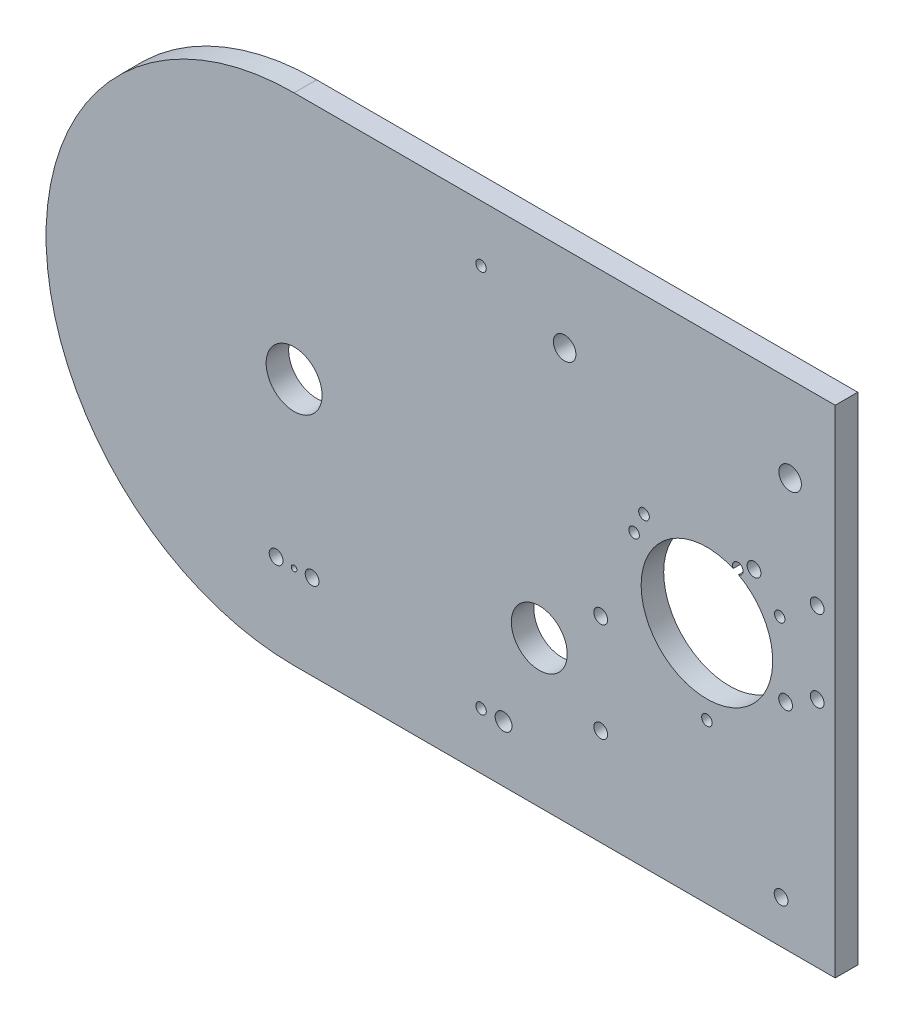
ISO-10303-21;
HEADER;
FILE_DESCRIPTION(('STEP AP214'),'2;1');
FILE_NAME('part.step','',(''),(''),'','','');
FILE_SCHEMA(('AUTOMOTIVE_DESIGN { 1 0 10303 214 1 1 1 1 }'));
ENDSEC;
DATA;
#1=APPLICATION_CONTEXT('core data for automotive mechanical design processes');
#2=APPLICATION_PROTOCOL_DEFINITION('international standard','automotive_design',2000,#1);
#3=PRODUCT_CONTEXT('',#1,'mechanical');
#4=PRODUCT('Part','Part','',(#3));
#5=PRODUCT_RELATED_PRODUCT_CATEGORY('part','',(#4));
#6=PRODUCT_DEFINITION_FORMATION('','',#4);
#7=PRODUCT_DEFINITION_CONTEXT('part definition',#1,'design');
#8=PRODUCT_DEFINITION('design','',#6,#7);
#9=PRODUCT_DEFINITION_SHAPE('','',#8);
#10=(LENGTH_UNIT() NAMED_UNIT(*) SI_UNIT(.MILLI.,.METRE.));
#11=(NAMED_UNIT(*) PLANE_ANGLE_UNIT() SI_UNIT($,.RADIAN.));
#12=(NAMED_UNIT(*) SI_UNIT($,.STERADIAN.) SOLID_ANGLE_UNIT());
#13=UNCERTAINTY_MEASURE_WITH_UNIT(LENGTH_MEASURE(1.E-05),#10,'distance_accuracy_value','');
#14=(GEOMETRIC_REPRESENTATION_CONTEXT(3) GLOBAL_UNCERTAINTY_ASSIGNED_CONTEXT((#13)) GLOBAL_UNIT_ASSIGNED_CONTEXT((#10,
#11,#12)) REPRESENTATION_CONTEXT('',''));
#15=CARTESIAN_POINT('',(0.,0.,0.));
#16=DIRECTION('',(0.,0.,1.));
#17=DIRECTION('',(1.,0.,0.));
#18=AXIS2_PLACEMENT_3D('',#15,#16,#17);
#19=CARTESIAN_POINT('',(0.,0.,-6.35));
#20=DIRECTION('',(0.,0.,-1.));
#21=DIRECTION('',(1.,0.,0.));
#22=AXIS2_PLACEMENT_3D('',#19,#20,#21);
#23=PLANE('',#22);
#24=CARTESIAN_POINT('',(116.268983634015,-25.0154088515495,-6.35));
#25=DIRECTION('',(0.,0.,-1.));
#26=DIRECTION('',(-1.,0.,0.));
#27=AXIS2_PLACEMENT_3D('',#24,#25,#26);
#28=CIRCLE('',#27,1.47319999999998);
#29=CARTESIAN_POINT('',(114.795783634015,-25.0154088515495,-6.35));
#30=VERTEX_POINT('',#29);
#31=EDGE_CURVE('E361',#30,#30,#28,.F.);
#32=ORIENTED_EDGE('',*,*,#31,.T.);
#33=EDGE_LOOP('',(#32));
#34=FACE_BOUND('',#33,.T.);
#35=CARTESIAN_POINT('',(136.769352977,10.4922724244268,-6.35));
#36=DIRECTION('',(0.,0.,-1.));
#37=DIRECTION('',(-1.,0.,0.));
#38=AXIS2_PLACEMENT_3D('',#35,#36,#37);
#39=CIRCLE('',#38,1.47319999999997);
#40=CARTESIAN_POINT('',(135.296152977,10.4922724244268,-6.35));
#41=VERTEX_POINT('',#40);
#42=EDGE_CURVE('E365',#41,#41,#39,.F.);
#43=ORIENTED_EDGE('',*,*,#42,.T.);
#44=EDGE_LOOP('',(#43));
#45=FACE_BOUND('',#44,.T.);
#46=CARTESIAN_POINT('',(95.7686142910309,10.4922724244268,-6.35));
#47=DIRECTION('',(0.,0.,-1.));
#48=DIRECTION('',(-1.,0.,0.));
#49=AXIS2_PLACEMENT_3D('',#46,#47,#48);
#50=CIRCLE('',#49,1.4732);
#51=CARTESIAN_POINT('',(94.2954142910309,10.4922724244268,-6.35));
#52=VERTEX_POINT('',#51);
#53=EDGE_CURVE('E373',#52,#52,#50,.F.);
#54=ORIENTED_EDGE('',*,*,#53,.T.);
#55=EDGE_LOOP('',(#54));
#56=FACE_BOUND('',#55,.T.);
#57=CARTESIAN_POINT('',(116.268983634015,-1.34362133423192,-6.35));
#58=DIRECTION('',(0.,0.,-1.));
#59=DIRECTION('',(-1.,0.,0.));
#60=AXIS2_PLACEMENT_3D('',#57,#58,#59);
#61=CIRCLE('',#60,18.5269999999999);
#62=CARTESIAN_POINT('',(123.664724974641,15.6432188375763,-6.35));
#63=VERTEX_POINT('',#62);
#64=CARTESIAN_POINT('',(125.180243201368,14.8995058869427,-6.35));
#65=VERTEX_POINT('',#64);
#66=EDGE_CURVE('E92',#63,#65,#61,.F.);
#67=ORIENTED_EDGE('',*,*,#66,.T.);
#68=CARTESIAN_POINT('',(124.968,16.382999999999,-6.35));
#69=DIRECTION('',(0.,0.,1.));
#70=DIRECTION('',(1.,0.,0.));
#71=AXIS2_PLACEMENT_3D('',#68,#69,#70);
#72=CIRCLE('',#71,1.49859999999997);
#73=EDGE_CURVE('E103',#65,#63,#72,.T.);
#74=ORIENTED_EDGE('',*,*,#73,.T.);
#75=EDGE_LOOP('',(#67,#74));
#76=FACE_BOUND('',#75,.T.);
#77=CARTESIAN_POINT('',(98.5519999999999,16.382999999999,-6.35));
#78=DIRECTION('',(0.,0.,1.));
#79=DIRECTION('',(1.,0.,0.));
#80=AXIS2_PLACEMENT_3D('',#77,#78,#79);
#81=CIRCLE('',#80,1.49859999999999);
#82=CARTESIAN_POINT('',(100.0506,16.382999999999,-6.35));
#83=VERTEX_POINT('',#82);
#84=EDGE_CURVE('E113',#83,#83,#81,.T.);
#85=ORIENTED_EDGE('',*,*,#84,.T.);
#86=EDGE_LOOP('',(#85));
#87=FACE_BOUND('',#86,.T.);
#88=CARTESIAN_POINT('',(59.0043258396006,-53.975,-6.35));
#89=DIRECTION('',(0.,0.,1.));
#90=DIRECTION('',(1.,0.,0.));
#91=AXIS2_PLACEMENT_3D('',#88,#89,#90);
#92=CIRCLE('',#91,2.38125);
#93=CARTESIAN_POINT('',(61.3855758396006,-53.975,-6.35));
#94=VERTEX_POINT('',#93);
#95=EDGE_CURVE('E110',#94,#94,#92,.T.);
#96=ORIENTED_EDGE('',*,*,#95,.T.);
#97=EDGE_LOOP('',(#96));
#98=FACE_BOUND('',#97,.T.);
#99=CARTESIAN_POINT('',(0.00594458088814826,-46.140475683147,-6.35));
#100=DIRECTION('',(0.,0.,1.));
#101=DIRECTION('',(1.,0.,0.));
#102=AXIS2_PLACEMENT_3D('',#99,#100,#101);
#103=CIRCLE('',#102,0.793749999999994);
#104=CARTESIAN_POINT('',(0.799694580888142,-46.140475683147,-6.35));
#105=VERTEX_POINT('',#104);
#106=EDGE_CURVE('E122',#105,#105,#103,.T.);
#107=ORIENTED_EDGE('',*,*,#106,.T.);
#108=EDGE_LOOP('',(#107));
#109=FACE_BOUND('',#108,.T.);
#110=CARTESIAN_POINT('',(129.54,18.414999999999,-6.35));
#111=DIRECTION('',(0.,0.,1.));
#112=DIRECTION('',(1.,0.,0.));
#113=AXIS2_PLACEMENT_3D('',#110,#111,#112);
#114=CIRCLE('',#113,1.94309999999998);
#115=CARTESIAN_POINT('',(131.4831,18.414999999999,-6.35));
#116=VERTEX_POINT('',#115);
#117=EDGE_CURVE('E128',#116,#116,#114,.T.);
#118=ORIENTED_EDGE('',*,*,#117,.T.);
#119=EDGE_LOOP('',(#118));
#120=FACE_BOUND('',#119,.T.);
#121=CARTESIAN_POINT('',(147.32,18.414999999999,-6.35));
#122=DIRECTION('',(0.,0.,1.));
#123=DIRECTION('',(1.,0.,0.));
#124=AXIS2_PLACEMENT_3D('',#121,#122,#123);
#125=CIRCLE('',#124,1.94309999999998);
#126=CARTESIAN_POINT('',(149.2631,18.414999999999,-6.35));
#127=VERTEX_POINT('',#126);
#128=EDGE_CURVE('E134',#127,#127,#125,.T.);
#129=ORIENTED_EDGE('',*,*,#128,.T.);
#130=EDGE_LOOP('',(#129));
#131=FACE_BOUND('',#130,.T.);
#132=CARTESIAN_POINT('',(147.32,-4.44500000000105,-6.35));
#133=DIRECTION('',(0.,0.,1.));
#134=DIRECTION('',(1.,0.,0.));
#135=AXIS2_PLACEMENT_3D('',#132,#133,#134);
#136=CIRCLE('',#135,1.94309999999998);
#137=CARTESIAN_POINT('',(149.2631,-4.44500000000105,-6.35));
#138=VERTEX_POINT('',#137);
#139=EDGE_CURVE('E140',#138,#138,#136,.T.);
#140=ORIENTED_EDGE('',*,*,#139,.T.);
#141=EDGE_LOOP('',(#140));
#142=FACE_BOUND('',#141,.T.);
#143=CARTESIAN_POINT('',(138.43,-9.52500000000096,-6.35));
#144=DIRECTION('',(0.,0.,1.));
#145=DIRECTION('',(1.,0.,0.));
#146=AXIS2_PLACEMENT_3D('',#143,#144,#145);
#147=CIRCLE('',#146,1.94309999999998);
#148=CARTESIAN_POINT('',(140.3731,-9.52500000000096,-6.35));
#149=VERTEX_POINT('',#148);
#150=EDGE_CURVE('E146',#149,#149,#147,.T.);
#151=ORIENTED_EDGE('',*,*,#150,.T.);
#152=EDGE_LOOP('',(#151));
#153=FACE_BOUND('',#152,.T.);
#154=CARTESIAN_POINT('',(86.3599999999988,-14.6050000000013,-6.35));
#155=DIRECTION('',(0.,0.,1.));
#156=DIRECTION('',(1.,0.,0.));
#157=AXIS2_PLACEMENT_3D('',#154,#155,#156);
#158=CIRCLE('',#157,1.94309999999999);
#159=CARTESIAN_POINT('',(88.3030999999988,-14.6050000000013,-6.35));
#160=VERTEX_POINT('',#159);
#161=EDGE_CURVE('E152',#160,#160,#158,.T.);
#162=ORIENTED_EDGE('',*,*,#161,.T.);
#163=EDGE_LOOP('',(#162));
#164=FACE_BOUND('',#163,.T.);
#165=CARTESIAN_POINT('',(86.36,-42.5449999999997,-6.35));
#166=DIRECTION('',(0.,0.,1.));
#167=DIRECTION('',(1.,0.,0.));
#168=AXIS2_PLACEMENT_3D('',#165,#166,#167);
#169=CIRCLE('',#168,1.94309999999999);
#170=CARTESIAN_POINT('',(88.3031,-42.5449999999997,-6.35));
#171=VERTEX_POINT('',#170);
#172=EDGE_CURVE('E158',#171,#171,#169,.T.);
#173=ORIENTED_EDGE('',*,*,#172,.T.);
#174=EDGE_LOOP('',(#173));
#175=FACE_BOUND('',#174,.T.);
#176=CARTESIAN_POINT('',(137.16,-57.785000000001,-6.35));
#177=DIRECTION('',(0.,0.,1.));
#178=DIRECTION('',(1.,0.,0.));
#179=AXIS2_PLACEMENT_3D('',#176,#177,#178);
#180=CIRCLE('',#179,1.94309999999998);
#181=CARTESIAN_POINT('',(139.1031,-57.785000000001,-6.35));
#182=VERTEX_POINT('',#181);
#183=EDGE_CURVE('E164',#182,#182,#180,.T.);
#184=ORIENTED_EDGE('',*,*,#183,.T.);
#185=EDGE_LOOP('',(#184));
#186=FACE_BOUND('',#185,.T.);
#187=CARTESIAN_POINT('',(5.07324458088815,-45.872975683147,-6.35));
#188=DIRECTION('',(0.,0.,1.));
#189=DIRECTION('',(1.,0.,0.));
#190=AXIS2_PLACEMENT_3D('',#187,#188,#189);
#191=CIRCLE('',#190,1.94309999999999);
#192=CARTESIAN_POINT('',(7.01634458088814,-45.872975683147,-6.35));
#193=VERTEX_POINT('',#192);
#194=EDGE_CURVE('E170',#193,#193,#191,.T.);
#195=ORIENTED_EDGE('',*,*,#194,.T.);
#196=EDGE_LOOP('',(#195));
#197=FACE_BOUND('',#196,.T.);
#198=CARTESIAN_POINT('',(-5.06135541911185,-45.872975683147,-6.35));
#199=DIRECTION('',(0.,0.,1.));
#200=DIRECTION('',(1.,0.,0.));
#201=AXIS2_PLACEMENT_3D('',#198,#199,#200);
#202=CIRCLE('',#201,1.94309999999999);
#203=CARTESIAN_POINT('',(-3.11825541911186,-45.872975683147,-6.35));
#204=VERTEX_POINT('',#203);
#205=EDGE_CURVE('E176',#204,#204,#202,.T.);
#206=ORIENTED_EDGE('',*,*,#205,.T.);
#207=EDGE_LOOP('',(#206));
#208=FACE_BOUND('',#207,.T.);
#209=CARTESIAN_POINT('',(52.6543258396006,53.9749999999996,-6.35));
#210=DIRECTION('',(0.,0.,1.));
#211=DIRECTION('',(1.,0.,0.));
#212=AXIS2_PLACEMENT_3D('',#209,#210,#211);
#213=CIRCLE('',#212,1.47319999999999);
#214=CARTESIAN_POINT('',(54.1275258396006,53.9749999999996,-6.35));
#215=VERTEX_POINT('',#214);
#216=EDGE_CURVE('E182',#215,#215,#213,.T.);
#217=ORIENTED_EDGE('',*,*,#216,.T.);
#218=EDGE_LOOP('',(#217));
#219=FACE_BOUND('',#218,.T.);
#220=CARTESIAN_POINT('',(52.6543258396006,-53.975,-6.35));
#221=DIRECTION('',(0.,0.,1.));
#222=DIRECTION('',(1.,0.,0.));
#223=AXIS2_PLACEMENT_3D('',#220,#221,#222);
#224=CIRCLE('',#223,1.47319999999999);
#225=CARTESIAN_POINT('',(54.1275258396006,-53.975,-6.35));
#226=VERTEX_POINT('',#225);
#227=EDGE_CURVE('E188',#226,#226,#224,.T.);
#228=ORIENTED_EDGE('',*,*,#227,.T.);
#229=EDGE_LOOP('',(#228));
#230=FACE_BOUND('',#229,.T.);
#231=CARTESIAN_POINT('',(139.7,45.72,-6.35));
#232=DIRECTION('',(0.,0.,1.));
#233=DIRECTION('',(1.,0.,0.));
#234=AXIS2_PLACEMENT_3D('',#231,#232,#233);
#235=CIRCLE('',#234,3.17499999999997);
#236=CARTESIAN_POINT('',(142.875,45.72,-6.35));
#237=VERTEX_POINT('',#236);
#238=EDGE_CURVE('E194',#237,#237,#235,.T.);
#239=ORIENTED_EDGE('',*,*,#238,.T.);
#240=EDGE_LOOP('',(#239));
#241=FACE_BOUND('',#240,.T.);
#242=CARTESIAN_POINT('',(76.2,45.72,-6.35));
#243=DIRECTION('',(0.,0.,1.));
#244=DIRECTION('',(1.,0.,0.));
#245=AXIS2_PLACEMENT_3D('',#242,#243,#244);
#246=CIRCLE('',#245,3.17499999999997);
#247=CARTESIAN_POINT('',(79.375,45.72,-6.35));
#248=VERTEX_POINT('',#247);
#249=EDGE_CURVE('E200',#248,#248,#246,.T.);
#250=ORIENTED_EDGE('',*,*,#249,.T.);
#251=EDGE_LOOP('',(#250));
#252=FACE_BOUND('',#251,.T.);
#253=CARTESIAN_POINT('',(69.0541023726346,-28.603145740244,-6.35));
#254=DIRECTION('',(0.,0.,1.));
#255=DIRECTION('',(1.,0.,0.));
#256=AXIS2_PLACEMENT_3D('',#253,#254,#255);
#257=CIRCLE('',#256,7.87399999999999);
#258=CARTESIAN_POINT('',(76.9281023726346,-28.603145740244,-6.35));
#259=VERTEX_POINT('',#258);
#260=EDGE_CURVE('E213',#259,#259,#257,.T.);
#261=ORIENTED_EDGE('',*,*,#260,.T.);
#262=EDGE_LOOP('',(#261));
#263=FACE_BOUND('',#262,.T.);
#264=CARTESIAN_POINT('',(0.,0.,-6.35));
#265=DIRECTION('',(0.,0.,1.));
#266=DIRECTION('',(1.,0.,0.));
#267=AXIS2_PLACEMENT_3D('',#264,#265,#266);
#268=CIRCLE('',#267,69.85);
#269=CARTESIAN_POINT('',(0.,69.85,-6.35));
#270=VERTEX_POINT('',#269);
#271=CARTESIAN_POINT('',(0.,-69.85,-6.35));
#272=VERTEX_POINT('',#271);
#273=EDGE_CURVE('E219',#270,#272,#268,.T.);
#274=ORIENTED_EDGE('',*,*,#273,.F.);
#275=DIRECTION('',(-1.,0.,0.));
#276=VECTOR('',#275,1.);
#277=CARTESIAN_POINT('',(0.,69.85,-6.35));
#278=LINE('',#277,#276);
#279=CARTESIAN_POINT('',(152.4,69.85,-6.35));
#280=VERTEX_POINT('',#279);
#281=EDGE_CURVE('E227',#280,#270,#278,.T.);
#282=ORIENTED_EDGE('',*,*,#281,.F.);
#283=DIRECTION('',(0.,1.,0.));
#284=VECTOR('',#283,1.);
#285=CARTESIAN_POINT('',(152.4,69.85,-6.35));
#286=LINE('',#285,#284);
#287=CARTESIAN_POINT('',(152.4,-69.85,-6.35));
#288=VERTEX_POINT('',#287);
#289=EDGE_CURVE('E224',#288,#280,#286,.T.);
#290=ORIENTED_EDGE('',*,*,#289,.F.);
#291=DIRECTION('',(1.,0.,0.));
#292=VECTOR('',#291,1.);
#293=CARTESIAN_POINT('',(0.,-69.85,-6.35));
#294=LINE('',#293,#292);
#295=EDGE_CURVE('E221',#272,#288,#294,.T.);
#296=ORIENTED_EDGE('',*,*,#295,.F.);
#297=EDGE_LOOP('',(#274,#282,#290,#296));
#298=FACE_BOUND('',#297,.T.);
#299=CARTESIAN_POINT('',(0.,0.,-6.35));
#300=DIRECTION('',(0.,0.,1.));
#301=DIRECTION('',(1.,0.,0.));
#302=AXIS2_PLACEMENT_3D('',#299,#300,#301);
#303=CIRCLE('',#302,7.874);
#304=CARTESIAN_POINT('',(7.874,0.,-6.35));
#305=VERTEX_POINT('',#304);
#306=EDGE_CURVE('E207',#305,#305,#303,.T.);
#307=ORIENTED_EDGE('',*,*,#306,.T.);
#308=EDGE_LOOP('',(#307));
#309=FACE_BOUND('',#308,.T.);
#310=ADVANCED_FACE('F32',(#34,#45,#56,#76,#87,#98,#109,#120,#131,#142,#153,#164,#175,#186,#197,
#208,#219,#230,#241,#252,#263,#298,#309),#23,.T.);
#311=CARTESIAN_POINT('',(0.,0.,0.));
#312=DIRECTION('',(0.,0.,-1.));
#313=DIRECTION('',(1.,0.,0.));
#314=AXIS2_PLACEMENT_3D('',#311,#312,#313);
#315=PLANE('',#314);
#316=CARTESIAN_POINT('',(116.268983634015,-25.0154088515495,0.));
#317=DIRECTION('',(0.,0.,1.));
#318=DIRECTION('',(1.,0.,0.));
#319=AXIS2_PLACEMENT_3D('',#316,#317,#318);
#320=CIRCLE('',#319,1.47319999999998);
#321=CARTESIAN_POINT('',(117.742183634015,-25.0154088515495,0.));
#322=VERTEX_POINT('',#321);
#323=EDGE_CURVE('E364',#322,#322,#320,.T.);
#324=ORIENTED_EDGE('',*,*,#323,.F.);
#325=EDGE_LOOP('',(#324));
#326=FACE_BOUND('',#325,.T.);
#327=CARTESIAN_POINT('',(136.769352977,10.4922724244268,0.));
#328=DIRECTION('',(0.,0.,1.));
#329=DIRECTION('',(1.,0.,0.));
#330=AXIS2_PLACEMENT_3D('',#327,#328,#329);
#331=CIRCLE('',#330,1.47319999999997);
#332=CARTESIAN_POINT('',(138.242552977,10.4922724244268,0.));
#333=VERTEX_POINT('',#332);
#334=EDGE_CURVE('E368',#333,#333,#331,.T.);
#335=ORIENTED_EDGE('',*,*,#334,.F.);
#336=EDGE_LOOP('',(#335));
#337=FACE_BOUND('',#336,.T.);
#338=CARTESIAN_POINT('',(95.7686142910309,10.4922724244268,0.));
#339=DIRECTION('',(0.,0.,1.));
#340=DIRECTION('',(1.,0.,0.));
#341=AXIS2_PLACEMENT_3D('',#338,#339,#340);
#342=CIRCLE('',#341,1.4732);
#343=CARTESIAN_POINT('',(97.2418142910309,10.4922724244268,0.));
#344=VERTEX_POINT('',#343);
#345=EDGE_CURVE('E98',#344,#344,#342,.T.);
#346=ORIENTED_EDGE('',*,*,#345,.F.);
#347=EDGE_LOOP('',(#346));
#348=FACE_BOUND('',#347,.T.);
#349=CARTESIAN_POINT('',(98.5519999999999,16.382999999999,0.));
#350=DIRECTION('',(0.,0.,1.));
#351=DIRECTION('',(1.,0.,0.));
#352=AXIS2_PLACEMENT_3D('',#349,#350,#351);
#353=CIRCLE('',#352,1.4986);
#354=CARTESIAN_POINT('',(100.0506,16.382999999999,0.));
#355=VERTEX_POINT('',#354);
#356=EDGE_CURVE('E108',#355,#355,#353,.T.);
#357=ORIENTED_EDGE('',*,*,#356,.F.);
#358=EDGE_LOOP('',(#357));
#359=FACE_BOUND('',#358,.T.);
#360=CARTESIAN_POINT('',(124.968,16.382999999999,0.));
#361=DIRECTION('',(0.,0.,1.));
#362=DIRECTION('',(1.,0.,0.));
#363=AXIS2_PLACEMENT_3D('',#360,#361,#362);
#364=CIRCLE('',#363,1.49859999999999);
#365=CARTESIAN_POINT('',(125.180243201368,14.8995058869426,0.));
#366=VERTEX_POINT('',#365);
#367=CARTESIAN_POINT('',(123.664724974641,15.6432188375763,0.));
#368=VERTEX_POINT('',#367);
#369=EDGE_CURVE('E107',#366,#368,#364,.T.);
#370=ORIENTED_EDGE('',*,*,#369,.F.);
#371=CARTESIAN_POINT('',(116.268983634015,-1.34362133423192,0.));
#372=DIRECTION('',(0.,0.,-1.));
#373=DIRECTION('',(-1.,0.,0.));
#374=AXIS2_PLACEMENT_3D('',#371,#372,#373);
#375=CIRCLE('',#374,18.5269999999999);
#376=EDGE_CURVE('E47',#368,#366,#375,.F.);
#377=ORIENTED_EDGE('',*,*,#376,.F.);
#378=EDGE_LOOP('',(#370,#377));
#379=FACE_BOUND('',#378,.T.);
#380=CARTESIAN_POINT('',(59.0043258396006,-53.975,0.));
#381=DIRECTION('',(0.,0.,1.));
#382=DIRECTION('',(1.,0.,0.));
#383=AXIS2_PLACEMENT_3D('',#380,#381,#382);
#384=CIRCLE('',#383,2.38125);
#385=CARTESIAN_POINT('',(61.3855758396006,-53.975,0.));
#386=VERTEX_POINT('',#385);
#387=EDGE_CURVE('E119',#386,#386,#384,.F.);
#388=ORIENTED_EDGE('',*,*,#387,.T.);
#389=EDGE_LOOP('',(#388));
#390=FACE_BOUND('',#389,.T.);
#391=CARTESIAN_POINT('',(0.00594458088814826,-46.140475683147,0.));
#392=DIRECTION('',(0.,0.,1.));
#393=DIRECTION('',(1.,0.,0.));
#394=AXIS2_PLACEMENT_3D('',#391,#392,#393);
#395=CIRCLE('',#394,0.793749999999994);
#396=CARTESIAN_POINT('',(0.799694580888142,-46.140475683147,0.));
#397=VERTEX_POINT('',#396);
#398=EDGE_CURVE('E125',#397,#397,#395,.F.);
#399=ORIENTED_EDGE('',*,*,#398,.T.);
#400=EDGE_LOOP('',(#399));
#401=FACE_BOUND('',#400,.T.);
#402=CARTESIAN_POINT('',(129.54,18.414999999999,0.));
#403=DIRECTION('',(0.,0.,1.));
#404=DIRECTION('',(1.,0.,0.));
#405=AXIS2_PLACEMENT_3D('',#402,#403,#404);
#406=CIRCLE('',#405,1.94309999999999);
#407=CARTESIAN_POINT('',(131.4831,18.414999999999,0.));
#408=VERTEX_POINT('',#407);
#409=EDGE_CURVE('E131',#408,#408,#406,.T.);
#410=ORIENTED_EDGE('',*,*,#409,.F.);
#411=EDGE_LOOP('',(#410));
#412=FACE_BOUND('',#411,.T.);
#413=CARTESIAN_POINT('',(147.32,18.414999999999,0.));
#414=DIRECTION('',(0.,0.,1.));
#415=DIRECTION('',(1.,0.,0.));
#416=AXIS2_PLACEMENT_3D('',#413,#414,#415);
#417=CIRCLE('',#416,1.94309999999999);
#418=CARTESIAN_POINT('',(149.2631,18.414999999999,0.));
#419=VERTEX_POINT('',#418);
#420=EDGE_CURVE('E137',#419,#419,#417,.T.);
#421=ORIENTED_EDGE('',*,*,#420,.F.);
#422=EDGE_LOOP('',(#421));
#423=FACE_BOUND('',#422,.T.);
#424=CARTESIAN_POINT('',(147.32,-4.44500000000105,0.));
#425=DIRECTION('',(0.,0.,1.));
#426=DIRECTION('',(1.,0.,0.));
#427=AXIS2_PLACEMENT_3D('',#424,#425,#426);
#428=CIRCLE('',#427,1.94309999999999);
#429=CARTESIAN_POINT('',(149.2631,-4.44500000000105,0.));
#430=VERTEX_POINT('',#429);
#431=EDGE_CURVE('E143',#430,#430,#428,.T.);
#432=ORIENTED_EDGE('',*,*,#431,.F.);
#433=EDGE_LOOP('',(#432));
#434=FACE_BOUND('',#433,.T.);
#435=CARTESIAN_POINT('',(138.43,-9.52500000000096,0.));
#436=DIRECTION('',(0.,0.,1.));
#437=DIRECTION('',(1.,0.,0.));
#438=AXIS2_PLACEMENT_3D('',#435,#436,#437);
#439=CIRCLE('',#438,1.94309999999999);
#440=CARTESIAN_POINT('',(140.3731,-9.52500000000096,0.));
#441=VERTEX_POINT('',#440);
#442=EDGE_CURVE('E149',#441,#441,#439,.T.);
#443=ORIENTED_EDGE('',*,*,#442,.F.);
#444=EDGE_LOOP('',(#443));
#445=FACE_BOUND('',#444,.T.);
#446=CARTESIAN_POINT('',(86.3599999999988,-14.6050000000013,0.));
#447=DIRECTION('',(0.,0.,1.));
#448=DIRECTION('',(1.,0.,0.));
#449=AXIS2_PLACEMENT_3D('',#446,#447,#448);
#450=CIRCLE('',#449,1.9431);
#451=CARTESIAN_POINT('',(88.3030999999988,-14.6050000000013,0.));
#452=VERTEX_POINT('',#451);
#453=EDGE_CURVE('E155',#452,#452,#450,.T.);
#454=ORIENTED_EDGE('',*,*,#453,.F.);
#455=EDGE_LOOP('',(#454));
#456=FACE_BOUND('',#455,.T.);
#457=CARTESIAN_POINT('',(86.36,-42.5449999999997,0.));
#458=DIRECTION('',(0.,0.,1.));
#459=DIRECTION('',(1.,0.,0.));
#460=AXIS2_PLACEMENT_3D('',#457,#458,#459);
#461=CIRCLE('',#460,1.9431);
#462=CARTESIAN_POINT('',(88.3031,-42.5449999999997,0.));
#463=VERTEX_POINT('',#462);
#464=EDGE_CURVE('E161',#463,#463,#461,.T.);
#465=ORIENTED_EDGE('',*,*,#464,.F.);
#466=EDGE_LOOP('',(#465));
#467=FACE_BOUND('',#466,.T.);
#468=CARTESIAN_POINT('',(137.16,-57.785000000001,0.));
#469=DIRECTION('',(0.,0.,1.));
#470=DIRECTION('',(1.,0.,0.));
#471=AXIS2_PLACEMENT_3D('',#468,#469,#470);
#472=CIRCLE('',#471,1.94309999999999);
#473=CARTESIAN_POINT('',(139.1031,-57.785000000001,0.));
#474=VERTEX_POINT('',#473);
#475=EDGE_CURVE('E167',#474,#474,#472,.T.);
#476=ORIENTED_EDGE('',*,*,#475,.F.);
#477=EDGE_LOOP('',(#476));
#478=FACE_BOUND('',#477,.T.);
#479=CARTESIAN_POINT('',(5.07324458088815,-45.872975683147,0.));
#480=DIRECTION('',(0.,0.,1.));
#481=DIRECTION('',(1.,0.,0.));
#482=AXIS2_PLACEMENT_3D('',#479,#480,#481);
#483=CIRCLE('',#482,1.94309999999999);
#484=CARTESIAN_POINT('',(7.01634458088815,-45.872975683147,0.));
#485=VERTEX_POINT('',#484);
#486=EDGE_CURVE('E173',#485,#485,#483,.T.);
#487=ORIENTED_EDGE('',*,*,#486,.F.);
#488=EDGE_LOOP('',(#487));
#489=FACE_BOUND('',#488,.T.);
#490=CARTESIAN_POINT('',(-5.06135541911185,-45.872975683147,0.));
#491=DIRECTION('',(0.,0.,1.));
#492=DIRECTION('',(1.,0.,0.));
#493=AXIS2_PLACEMENT_3D('',#490,#491,#492);
#494=CIRCLE('',#493,1.94309999999999);
#495=CARTESIAN_POINT('',(-3.11825541911185,-45.872975683147,0.));
#496=VERTEX_POINT('',#495);
#497=EDGE_CURVE('E179',#496,#496,#494,.T.);
#498=ORIENTED_EDGE('',*,*,#497,.F.);
#499=EDGE_LOOP('',(#498));
#500=FACE_BOUND('',#499,.T.);
#501=CARTESIAN_POINT('',(52.6543258396006,53.9749999999996,0.));
#502=DIRECTION('',(0.,0.,1.));
#503=DIRECTION('',(1.,0.,0.));
#504=AXIS2_PLACEMENT_3D('',#501,#502,#503);
#505=CIRCLE('',#504,1.47319999999999);
#506=CARTESIAN_POINT('',(54.1275258396006,53.9749999999996,0.));
#507=VERTEX_POINT('',#506);
#508=EDGE_CURVE('E185',#507,#507,#505,.T.);
#509=ORIENTED_EDGE('',*,*,#508,.F.);
#510=EDGE_LOOP('',(#509));
#511=FACE_BOUND('',#510,.T.);
#512=CARTESIAN_POINT('',(52.6543258396006,-53.975,0.));
#513=DIRECTION('',(0.,0.,1.));
#514=DIRECTION('',(1.,0.,0.));
#515=AXIS2_PLACEMENT_3D('',#512,#513,#514);
#516=CIRCLE('',#515,1.47319999999999);
#517=CARTESIAN_POINT('',(54.1275258396006,-53.975,0.));
#518=VERTEX_POINT('',#517);
#519=EDGE_CURVE('E191',#518,#518,#516,.T.);
#520=ORIENTED_EDGE('',*,*,#519,.F.);
#521=EDGE_LOOP('',(#520));
#522=FACE_BOUND('',#521,.T.);
#523=CARTESIAN_POINT('',(139.7,45.72,0.));
#524=DIRECTION('',(0.,0.,1.));
#525=DIRECTION('',(1.,0.,0.));
#526=AXIS2_PLACEMENT_3D('',#523,#524,#525);
#527=CIRCLE('',#526,3.17499999999997);
#528=CARTESIAN_POINT('',(142.875,45.72,0.));
#529=VERTEX_POINT('',#528);
#530=EDGE_CURVE('E197',#529,#529,#527,.F.);
#531=ORIENTED_EDGE('',*,*,#530,.T.);
#532=EDGE_LOOP('',(#531));
#533=FACE_BOUND('',#532,.T.);
#534=CARTESIAN_POINT('',(76.2,45.72,0.));
#535=DIRECTION('',(0.,0.,1.));
#536=DIRECTION('',(1.,0.,0.));
#537=AXIS2_PLACEMENT_3D('',#534,#535,#536);
#538=CIRCLE('',#537,3.17499999999997);
#539=CARTESIAN_POINT('',(79.375,45.72,0.));
#540=VERTEX_POINT('',#539);
#541=EDGE_CURVE('E203',#540,#540,#538,.F.);
#542=ORIENTED_EDGE('',*,*,#541,.T.);
#543=EDGE_LOOP('',(#542));
#544=FACE_BOUND('',#543,.T.);
#545=CARTESIAN_POINT('',(69.0541023726346,-28.603145740244,0.));
#546=DIRECTION('',(0.,0.,1.));
#547=DIRECTION('',(1.,0.,0.));
#548=AXIS2_PLACEMENT_3D('',#545,#546,#547);
#549=CIRCLE('',#548,7.87399999999999);
#550=CARTESIAN_POINT('',(76.9281023726346,-28.603145740244,0.));
#551=VERTEX_POINT('',#550);
#552=EDGE_CURVE('E210',#551,#551,#549,.T.);
#553=ORIENTED_EDGE('',*,*,#552,.F.);
#554=EDGE_LOOP('',(#553));
#555=FACE_BOUND('',#554,.T.);
#556=CARTESIAN_POINT('',(0.,0.,0.));
#557=DIRECTION('',(0.,0.,1.));
#558=DIRECTION('',(1.,0.,0.));
#559=AXIS2_PLACEMENT_3D('',#556,#557,#558);
#560=CIRCLE('',#559,69.85);
#561=CARTESIAN_POINT('',(0.,69.85,0.));
#562=VERTEX_POINT('',#561);
#563=CARTESIAN_POINT('',(0.,-69.85,0.));
#564=VERTEX_POINT('',#563);
#565=EDGE_CURVE('E216',#562,#564,#560,.T.);
#566=ORIENTED_EDGE('',*,*,#565,.T.);
#567=DIRECTION('',(1.,0.,0.));
#568=VECTOR('',#567,1.);
#569=CARTESIAN_POINT('',(0.,-69.85,0.));
#570=LINE('',#569,#568);
#571=CARTESIAN_POINT('',(152.4,-69.85,0.));
#572=VERTEX_POINT('',#571);
#573=EDGE_CURVE('E231',#564,#572,#570,.T.);
#574=ORIENTED_EDGE('',*,*,#573,.T.);
#575=DIRECTION('',(0.,1.,0.));
#576=VECTOR('',#575,1.);
#577=CARTESIAN_POINT('',(152.4,69.85,0.));
#578=LINE('',#577,#576);
#579=CARTESIAN_POINT('',(152.4,69.85,0.));
#580=VERTEX_POINT('',#579);
#581=EDGE_CURVE('E234',#572,#580,#578,.T.);
#582=ORIENTED_EDGE('',*,*,#581,.T.);
#583=DIRECTION('',(-1.,0.,0.));
#584=VECTOR('',#583,1.);
#585=CARTESIAN_POINT('',(0.,69.85,0.));
#586=LINE('',#585,#584);
#587=EDGE_CURVE('E222',#580,#562,#586,.T.);
#588=ORIENTED_EDGE('',*,*,#587,.T.);
#589=EDGE_LOOP('',(#566,#574,#582,#588));
#590=FACE_BOUND('',#589,.T.);
#591=CARTESIAN_POINT('',(0.,0.,0.));
#592=DIRECTION('',(0.,0.,1.));
#593=DIRECTION('',(1.,0.,0.));
#594=AXIS2_PLACEMENT_3D('',#591,#592,#593);
#595=CIRCLE('',#594,7.874);
#596=CARTESIAN_POINT('',(7.874,0.,0.));
#597=VERTEX_POINT('',#596);
#598=EDGE_CURVE('E206',#597,#597,#595,.T.);
#599=ORIENTED_EDGE('',*,*,#598,.F.);
#600=EDGE_LOOP('',(#599));
#601=FACE_BOUND('',#600,.T.);
#602=ADVANCED_FACE('F246',(#326,#337,#348,#359,#379,#390,#401,#412,#423,#434,#445,#456,#467,
#478,#489,#500,#511,#522,#533,#544,#555,#590,#601),#315,.F.);
#603=CARTESIAN_POINT('',(0.,0.,-6.35));
#604=DIRECTION('',(0.,0.,1.));
#605=DIRECTION('',(-1.,0.,0.));
#606=AXIS2_PLACEMENT_3D('',#603,#604,#605);
#607=CYLINDRICAL_SURFACE('',#606,69.85);
#608=ORIENTED_EDGE('',*,*,#565,.F.);
#609=DIRECTION('',(0.,0.,1.));
#610=VECTOR('',#609,1.);
#611=CARTESIAN_POINT('',(0.,69.85,-6.35));
#612=LINE('',#611,#610);
#613=EDGE_CURVE('E56',#270,#562,#612,.T.);
#614=ORIENTED_EDGE('',*,*,#613,.F.);
#615=ORIENTED_EDGE('',*,*,#273,.T.);
#616=DIRECTION('',(0.,0.,1.));
#617=VECTOR('',#616,1.);
#618=CARTESIAN_POINT('',(0.,-69.85,-6.35));
#619=LINE('',#618,#617);
#620=EDGE_CURVE('E11',#272,#564,#619,.T.);
#621=ORIENTED_EDGE('',*,*,#620,.T.);
#622=EDGE_LOOP('',(#608,#614,#615,#621));
#623=FACE_BOUND('',#622,.T.);
#624=ADVANCED_FACE('F34',(#623),#607,.T.);
#625=CARTESIAN_POINT('',(0.,-69.85,-6.35));
#626=DIRECTION('',(0.,1.,0.));
#627=DIRECTION('',(0.,0.,-1.));
#628=AXIS2_PLACEMENT_3D('',#625,#626,#627);
#629=PLANE('',#628);
#630=ORIENTED_EDGE('',*,*,#573,.F.);
#631=ORIENTED_EDGE('',*,*,#620,.F.);
#632=ORIENTED_EDGE('',*,*,#295,.T.);
#633=DIRECTION('',(0.,0.,1.));
#634=VECTOR('',#633,1.);
#635=CARTESIAN_POINT('',(152.4,-69.85,-6.35));
#636=LINE('',#635,#634);
#637=EDGE_CURVE('E40',#288,#572,#636,.T.);
#638=ORIENTED_EDGE('',*,*,#637,.T.);
#639=EDGE_LOOP('',(#630,#631,#632,#638));
#640=FACE_BOUND('',#639,.T.);
#641=ADVANCED_FACE('F241',(#640),#629,.F.);
#642=CARTESIAN_POINT('',(152.4,69.85,-6.35));
#643=DIRECTION('',(-1.,0.,0.));
#644=DIRECTION('',(0.,0.,-1.));
#645=AXIS2_PLACEMENT_3D('',#642,#643,#644);
#646=PLANE('',#645);
#647=ORIENTED_EDGE('',*,*,#581,.F.);
#648=ORIENTED_EDGE('',*,*,#637,.F.);
#649=ORIENTED_EDGE('',*,*,#289,.T.);
#650=DIRECTION('',(0.,0.,1.));
#651=VECTOR('',#650,1.);
#652=CARTESIAN_POINT('',(152.4,69.85,-6.35));
#653=LINE('',#652,#651);
#654=EDGE_CURVE('E239',#280,#580,#653,.T.);
#655=ORIENTED_EDGE('',*,*,#654,.T.);
#656=EDGE_LOOP('',(#647,#648,#649,#655));
#657=FACE_BOUND('',#656,.T.);
#658=ADVANCED_FACE('F244',(#657),#646,.F.);
#659=CARTESIAN_POINT('',(0.,69.85,-6.35));
#660=DIRECTION('',(0.,-1.,0.));
#661=DIRECTION('',(0.,0.,1.));
#662=AXIS2_PLACEMENT_3D('',#659,#660,#661);
#663=PLANE('',#662);
#664=ORIENTED_EDGE('',*,*,#587,.F.);
#665=ORIENTED_EDGE('',*,*,#654,.F.);
#666=ORIENTED_EDGE('',*,*,#281,.T.);
#667=ORIENTED_EDGE('',*,*,#613,.T.);
#668=EDGE_LOOP('',(#664,#665,#666,#667));
#669=FACE_BOUND('',#668,.T.);
#670=ADVANCED_FACE('F252',(#669),#663,.F.);
#671=CARTESIAN_POINT('',(69.0541023726346,-28.603145740244,-6.35));
#672=DIRECTION('',(0.,0.,1.));
#673=DIRECTION('',(-1.,0.,0.));
#674=AXIS2_PLACEMENT_3D('',#671,#672,#673);
#675=CYLINDRICAL_SURFACE('',#674,7.87399999999999);
#676=ORIENTED_EDGE('',*,*,#260,.F.);
#677=EDGE_LOOP('',(#676));
#678=FACE_BOUND('',#677,.T.);
#679=ORIENTED_EDGE('',*,*,#552,.T.);
#680=EDGE_LOOP('',(#679));
#681=FACE_BOUND('',#680,.T.);
#682=ADVANCED_FACE('F254',(#678,#681),#675,.F.);
#683=CARTESIAN_POINT('',(0.,0.,-6.35));
#684=DIRECTION('',(0.,0.,1.));
#685=DIRECTION('',(-1.,0.,0.));
#686=AXIS2_PLACEMENT_3D('',#683,#684,#685);
#687=CYLINDRICAL_SURFACE('',#686,7.874);
#688=ORIENTED_EDGE('',*,*,#306,.F.);
#689=EDGE_LOOP('',(#688));
#690=FACE_BOUND('',#689,.T.);
#691=ORIENTED_EDGE('',*,*,#598,.T.);
#692=EDGE_LOOP('',(#691));
#693=FACE_BOUND('',#692,.T.);
#694=ADVANCED_FACE('F260',(#690,#693),#687,.F.);
#695=CARTESIAN_POINT('',(76.2,45.72,0.00100000000000013));
#696=DIRECTION('',(0.,0.,-1.));
#697=DIRECTION('',(1.,0.,0.));
#698=AXIS2_PLACEMENT_3D('',#695,#696,#697);
#699=CYLINDRICAL_SURFACE('',#698,3.17499999999997);
#700=ORIENTED_EDGE('',*,*,#249,.F.);
#701=EDGE_LOOP('',(#700));
#702=FACE_BOUND('',#701,.T.);
#703=ORIENTED_EDGE('',*,*,#541,.F.);
#704=EDGE_LOOP('',(#703));
#705=FACE_BOUND('',#704,.T.);
#706=ADVANCED_FACE('F277',(#702,#705),#699,.F.);
#707=CARTESIAN_POINT('',(139.7,45.72,0.00100000000000013));
#708=DIRECTION('',(0.,0.,-1.));
#709=DIRECTION('',(1.,0.,0.));
#710=AXIS2_PLACEMENT_3D('',#707,#708,#709);
#711=CYLINDRICAL_SURFACE('',#710,3.17499999999997);
#712=ORIENTED_EDGE('',*,*,#238,.F.);
#713=EDGE_LOOP('',(#712));
#714=FACE_BOUND('',#713,.T.);
#715=ORIENTED_EDGE('',*,*,#530,.F.);
#716=EDGE_LOOP('',(#715));
#717=FACE_BOUND('',#716,.T.);
#718=ADVANCED_FACE('F281',(#714,#717),#711,.F.);
#719=CARTESIAN_POINT('',(52.6543258396006,-53.975,-6.35));
#720=DIRECTION('',(0.,0.,-1.));
#721=DIRECTION('',(1.,0.,0.));
#722=AXIS2_PLACEMENT_3D('',#719,#720,#721);
#723=CYLINDRICAL_SURFACE('',#722,1.47319999999999);
#724=ORIENTED_EDGE('',*,*,#519,.T.);
#725=EDGE_LOOP('',(#724));
#726=FACE_BOUND('',#725,.T.);
#727=ORIENTED_EDGE('',*,*,#227,.F.);
#728=EDGE_LOOP('',(#727));
#729=FACE_BOUND('',#728,.T.);
#730=ADVANCED_FACE('F285',(#726,#729),#723,.F.);
#731=CARTESIAN_POINT('',(52.6543258396006,53.9749999999996,-6.35));
#732=DIRECTION('',(0.,0.,-1.));
#733=DIRECTION('',(1.,0.,0.));
#734=AXIS2_PLACEMENT_3D('',#731,#732,#733);
#735=CYLINDRICAL_SURFACE('',#734,1.47319999999999);
#736=ORIENTED_EDGE('',*,*,#508,.T.);
#737=EDGE_LOOP('',(#736));
#738=FACE_BOUND('',#737,.T.);
#739=ORIENTED_EDGE('',*,*,#216,.F.);
#740=EDGE_LOOP('',(#739));
#741=FACE_BOUND('',#740,.T.);
#742=ADVANCED_FACE('F289',(#738,#741),#735,.F.);
#743=CARTESIAN_POINT('',(-5.06135541911185,-45.872975683147,-6.35));
#744=DIRECTION('',(0.,0.,-1.));
#745=DIRECTION('',(1.,0.,0.));
#746=AXIS2_PLACEMENT_3D('',#743,#744,#745);
#747=CYLINDRICAL_SURFACE('',#746,1.94309999999999);
#748=ORIENTED_EDGE('',*,*,#497,.T.);
#749=EDGE_LOOP('',(#748));
#750=FACE_BOUND('',#749,.T.);
#751=ORIENTED_EDGE('',*,*,#205,.F.);
#752=EDGE_LOOP('',(#751));
#753=FACE_BOUND('',#752,.T.);
#754=ADVANCED_FACE('F293',(#750,#753),#747,.F.);
#755=CARTESIAN_POINT('',(5.07324458088815,-45.872975683147,-6.35));
#756=DIRECTION('',(0.,0.,-1.));
#757=DIRECTION('',(1.,0.,0.));
#758=AXIS2_PLACEMENT_3D('',#755,#756,#757);
#759=CYLINDRICAL_SURFACE('',#758,1.94309999999999);
#760=ORIENTED_EDGE('',*,*,#486,.T.);
#761=EDGE_LOOP('',(#760));
#762=FACE_BOUND('',#761,.T.);
#763=ORIENTED_EDGE('',*,*,#194,.F.);
#764=EDGE_LOOP('',(#763));
#765=FACE_BOUND('',#764,.T.);
#766=ADVANCED_FACE('F297',(#762,#765),#759,.F.);
#767=CARTESIAN_POINT('',(137.16,-57.785000000001,-6.35));
#768=DIRECTION('',(0.,0.,-1.));
#769=DIRECTION('',(1.,0.,0.));
#770=AXIS2_PLACEMENT_3D('',#767,#768,#769);
#771=CYLINDRICAL_SURFACE('',#770,1.94309999999999);
#772=ORIENTED_EDGE('',*,*,#475,.T.);
#773=EDGE_LOOP('',(#772));
#774=FACE_BOUND('',#773,.T.);
#775=ORIENTED_EDGE('',*,*,#183,.F.);
#776=EDGE_LOOP('',(#775));
#777=FACE_BOUND('',#776,.T.);
#778=ADVANCED_FACE('F301',(#774,#777),#771,.F.);
#779=CARTESIAN_POINT('',(86.36,-42.5449999999997,-6.35));
#780=DIRECTION('',(0.,0.,-1.));
#781=DIRECTION('',(1.,0.,0.));
#782=AXIS2_PLACEMENT_3D('',#779,#780,#781);
#783=CYLINDRICAL_SURFACE('',#782,1.9431);
#784=ORIENTED_EDGE('',*,*,#464,.T.);
#785=EDGE_LOOP('',(#784));
#786=FACE_BOUND('',#785,.T.);
#787=ORIENTED_EDGE('',*,*,#172,.F.);
#788=EDGE_LOOP('',(#787));
#789=FACE_BOUND('',#788,.T.);
#790=ADVANCED_FACE('F305',(#786,#789),#783,.F.);
#791=CARTESIAN_POINT('',(86.3599999999988,-14.6050000000013,-6.35));
#792=DIRECTION('',(0.,0.,-1.));
#793=DIRECTION('',(1.,0.,0.));
#794=AXIS2_PLACEMENT_3D('',#791,#792,#793);
#795=CYLINDRICAL_SURFACE('',#794,1.9431);
#796=ORIENTED_EDGE('',*,*,#453,.T.);
#797=EDGE_LOOP('',(#796));
#798=FACE_BOUND('',#797,.T.);
#799=ORIENTED_EDGE('',*,*,#161,.F.);
#800=EDGE_LOOP('',(#799));
#801=FACE_BOUND('',#800,.T.);
#802=ADVANCED_FACE('F309',(#798,#801),#795,.F.);
#803=CARTESIAN_POINT('',(138.43,-9.52500000000096,-6.35));
#804=DIRECTION('',(0.,0.,-1.));
#805=DIRECTION('',(1.,0.,0.));
#806=AXIS2_PLACEMENT_3D('',#803,#804,#805);
#807=CYLINDRICAL_SURFACE('',#806,1.94309999999999);
#808=ORIENTED_EDGE('',*,*,#442,.T.);
#809=EDGE_LOOP('',(#808));
#810=FACE_BOUND('',#809,.T.);
#811=ORIENTED_EDGE('',*,*,#150,.F.);
#812=EDGE_LOOP('',(#811));
#813=FACE_BOUND('',#812,.T.);
#814=ADVANCED_FACE('F313',(#810,#813),#807,.F.);
#815=CARTESIAN_POINT('',(147.32,-4.44500000000105,-6.35));
#816=DIRECTION('',(0.,0.,-1.));
#817=DIRECTION('',(1.,0.,0.));
#818=AXIS2_PLACEMENT_3D('',#815,#816,#817);
#819=CYLINDRICAL_SURFACE('',#818,1.94309999999999);
#820=ORIENTED_EDGE('',*,*,#431,.T.);
#821=EDGE_LOOP('',(#820));
#822=FACE_BOUND('',#821,.T.);
#823=ORIENTED_EDGE('',*,*,#139,.F.);
#824=EDGE_LOOP('',(#823));
#825=FACE_BOUND('',#824,.T.);
#826=ADVANCED_FACE('F317',(#822,#825),#819,.F.);
#827=CARTESIAN_POINT('',(147.32,18.414999999999,-6.35));
#828=DIRECTION('',(0.,0.,-1.));
#829=DIRECTION('',(1.,0.,0.));
#830=AXIS2_PLACEMENT_3D('',#827,#828,#829);
#831=CYLINDRICAL_SURFACE('',#830,1.94309999999999);
#832=ORIENTED_EDGE('',*,*,#420,.T.);
#833=EDGE_LOOP('',(#832));
#834=FACE_BOUND('',#833,.T.);
#835=ORIENTED_EDGE('',*,*,#128,.F.);
#836=EDGE_LOOP('',(#835));
#837=FACE_BOUND('',#836,.T.);
#838=ADVANCED_FACE('F321',(#834,#837),#831,.F.);
#839=CARTESIAN_POINT('',(129.54,18.414999999999,-6.35));
#840=DIRECTION('',(0.,0.,-1.));
#841=DIRECTION('',(1.,0.,0.));
#842=AXIS2_PLACEMENT_3D('',#839,#840,#841);
#843=CYLINDRICAL_SURFACE('',#842,1.94309999999999);
#844=ORIENTED_EDGE('',*,*,#409,.T.);
#845=EDGE_LOOP('',(#844));
#846=FACE_BOUND('',#845,.T.);
#847=ORIENTED_EDGE('',*,*,#117,.F.);
#848=EDGE_LOOP('',(#847));
#849=FACE_BOUND('',#848,.T.);
#850=ADVANCED_FACE('F325',(#846,#849),#843,.F.);
#851=CARTESIAN_POINT('',(0.00594458088814826,-46.140475683147,0.00100000000000013));
#852=DIRECTION('',(0.,0.,-1.));
#853=DIRECTION('',(1.,0.,0.));
#854=AXIS2_PLACEMENT_3D('',#851,#852,#853);
#855=CYLINDRICAL_SURFACE('',#854,0.793749999999994);
#856=ORIENTED_EDGE('',*,*,#106,.F.);
#857=EDGE_LOOP('',(#856));
#858=FACE_BOUND('',#857,.T.);
#859=ORIENTED_EDGE('',*,*,#398,.F.);
#860=EDGE_LOOP('',(#859));
#861=FACE_BOUND('',#860,.T.);
#862=ADVANCED_FACE('F329',(#858,#861),#855,.F.);
#863=CARTESIAN_POINT('',(59.0043258396006,-53.975,0.00100000000000013));
#864=DIRECTION('',(0.,0.,-1.));
#865=DIRECTION('',(1.,0.,0.));
#866=AXIS2_PLACEMENT_3D('',#863,#864,#865);
#867=CYLINDRICAL_SURFACE('',#866,2.38125);
#868=ORIENTED_EDGE('',*,*,#95,.F.);
#869=EDGE_LOOP('',(#868));
#870=FACE_BOUND('',#869,.T.);
#871=ORIENTED_EDGE('',*,*,#387,.F.);
#872=EDGE_LOOP('',(#871));
#873=FACE_BOUND('',#872,.T.);
#874=ADVANCED_FACE('F333',(#870,#873),#867,.F.);
#875=CARTESIAN_POINT('',(124.968,16.382999999999,-6.35));
#876=DIRECTION('',(0.,0.,-1.));
#877=DIRECTION('',(1.,0.,0.));
#878=AXIS2_PLACEMENT_3D('',#875,#876,#877);
#879=CYLINDRICAL_SURFACE('',#878,1.49859999999999);
#880=ORIENTED_EDGE('',*,*,#369,.T.);
#881=DIRECTION('',(0.,0.,-1.));
#882=VECTOR('',#881,1.);
#883=CARTESIAN_POINT('',(123.664724974641,15.6432188375763,-3.175));
#884=LINE('',#883,#882);
#885=EDGE_CURVE('E104',#63,#368,#884,.F.);
#886=ORIENTED_EDGE('',*,*,#885,.F.);
#887=ORIENTED_EDGE('',*,*,#73,.F.);
#888=DIRECTION('',(0.,0.,-1.));
#889=VECTOR('',#888,1.);
#890=CARTESIAN_POINT('',(125.180243201368,14.8995058869426,-3.175));
#891=LINE('',#890,#889);
#892=EDGE_CURVE('E89',#366,#65,#891,.T.);
#893=ORIENTED_EDGE('',*,*,#892,.F.);
#894=EDGE_LOOP('',(#880,#886,#887,#893));
#895=FACE_BOUND('',#894,.T.);
#896=ADVANCED_FACE('F106',(#895),#879,.F.);
#897=CARTESIAN_POINT('',(98.5519999999999,16.382999999999,-6.35));
#898=DIRECTION('',(0.,0.,-1.));
#899=DIRECTION('',(1.,0.,0.));
#900=AXIS2_PLACEMENT_3D('',#897,#898,#899);
#901=CYLINDRICAL_SURFACE('',#900,1.4986);
#902=ORIENTED_EDGE('',*,*,#356,.T.);
#903=EDGE_LOOP('',(#902));
#904=FACE_BOUND('',#903,.T.);
#905=ORIENTED_EDGE('',*,*,#84,.F.);
#906=EDGE_LOOP('',(#905));
#907=FACE_BOUND('',#906,.T.);
#908=ADVANCED_FACE('F340',(#904,#907),#901,.F.);
#909=CARTESIAN_POINT('',(116.268983634015,-1.34362133423192,-6.351));
#910=DIRECTION('',(0.,0.,1.));
#911=DIRECTION('',(1.,0.,0.));
#912=AXIS2_PLACEMENT_3D('',#909,#910,#911);
#913=CYLINDRICAL_SURFACE('',#912,18.5269999999999);
#914=ORIENTED_EDGE('',*,*,#885,.T.);
#915=ORIENTED_EDGE('',*,*,#376,.T.);
#916=ORIENTED_EDGE('',*,*,#892,.T.);
#917=ORIENTED_EDGE('',*,*,#66,.F.);
#918=EDGE_LOOP('',(#914,#915,#916,#917));
#919=FACE_BOUND('',#918,.T.);
#920=ADVANCED_FACE('F91',(#919),#913,.F.);
#921=CARTESIAN_POINT('',(95.7686142910309,10.4922724244268,-6.351));
#922=DIRECTION('',(0.,0.,1.));
#923=DIRECTION('',(1.,0.,0.));
#924=AXIS2_PLACEMENT_3D('',#921,#922,#923);
#925=CYLINDRICAL_SURFACE('',#924,1.4732);
#926=ORIENTED_EDGE('',*,*,#53,.F.);
#927=EDGE_LOOP('',(#926));
#928=FACE_BOUND('',#927,.T.);
#929=ORIENTED_EDGE('',*,*,#345,.T.);
#930=EDGE_LOOP('',(#929));
#931=FACE_BOUND('',#930,.T.);
#932=ADVANCED_FACE('F346',(#928,#931),#925,.F.);
#933=CARTESIAN_POINT('',(136.769352977,10.4922724244268,-6.351));
#934=DIRECTION('',(0.,0.,1.));
#935=DIRECTION('',(1.,0.,0.));
#936=AXIS2_PLACEMENT_3D('',#933,#934,#935);
#937=CYLINDRICAL_SURFACE('',#936,1.47319999999997);
#938=ORIENTED_EDGE('',*,*,#42,.F.);
#939=EDGE_LOOP('',(#938));
#940=FACE_BOUND('',#939,.T.);
#941=ORIENTED_EDGE('',*,*,#334,.T.);
#942=EDGE_LOOP('',(#941));
#943=FACE_BOUND('',#942,.T.);
#944=ADVANCED_FACE('F349',(#940,#943),#937,.F.);
#945=CARTESIAN_POINT('',(116.268983634015,-25.0154088515495,-6.351));
#946=DIRECTION('',(0.,0.,1.));
#947=DIRECTION('',(1.,0.,0.));
#948=AXIS2_PLACEMENT_3D('',#945,#946,#947);
#949=CYLINDRICAL_SURFACE('',#948,1.47319999999998);
#950=ORIENTED_EDGE('',*,*,#31,.F.);
#951=EDGE_LOOP('',(#950));
#952=FACE_BOUND('',#951,.T.);
#953=ORIENTED_EDGE('',*,*,#323,.T.);
#954=EDGE_LOOP('',(#953));
#955=FACE_BOUND('',#954,.T.);
#956=ADVANCED_FACE('F353',(#952,#955),#949,.F.);
#957=CLOSED_SHELL('',(#310,#602,#624,#641,#658,#670,#682,#694,#706,#718,#730,#742,#754,#766,
#778,#790,#802,#814,#826,#838,#850,#862,#874,#896,#908,#920,#932,#944,#956));
#958=MANIFOLD_SOLID_BREP('B2',#957);
#959=ADVANCED_BREP_SHAPE_REPRESENTATION('',(#18,#958),#14);
#960=SHAPE_DEFINITION_REPRESENTATION(#9,#959);
ENDSEC;
END-ISO-10303-21;
